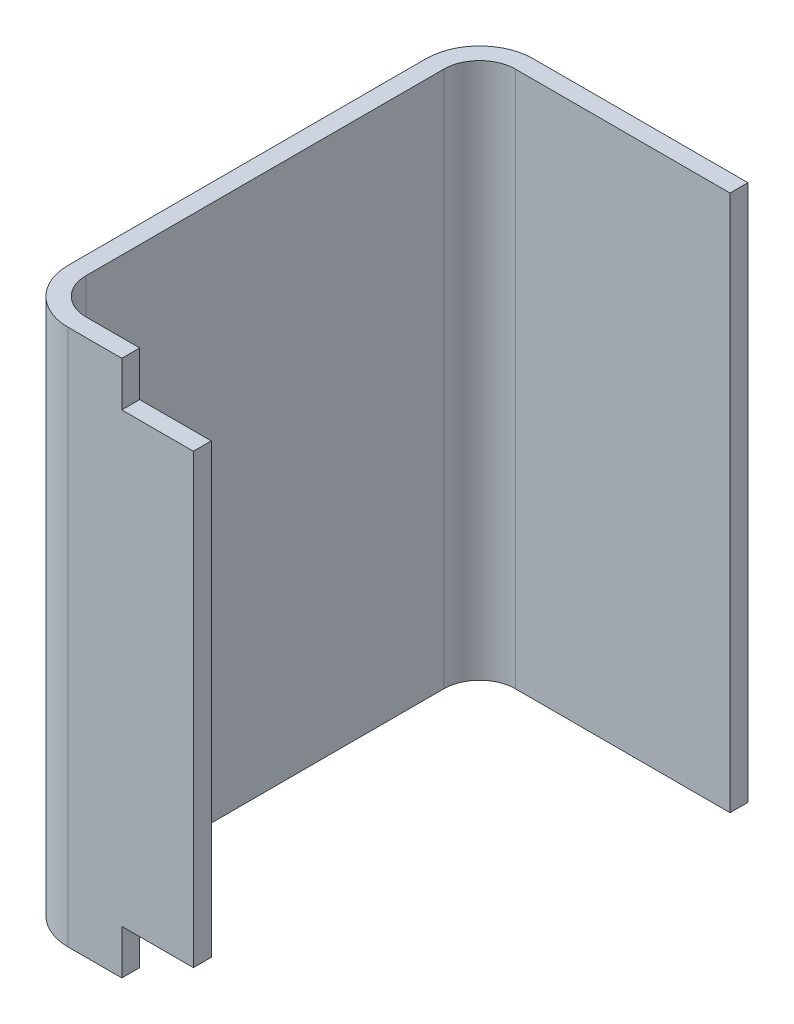
ISO-10303-21;
HEADER;
FILE_DESCRIPTION(('STEP AP214'),'2;1');
FILE_NAME('part.step','',(''),(''),'','','');
FILE_SCHEMA(('AUTOMOTIVE_DESIGN { 1 0 10303 214 1 1 1 1 }'));
ENDSEC;
DATA;
#1=APPLICATION_CONTEXT('core data for automotive mechanical design processes');
#2=APPLICATION_PROTOCOL_DEFINITION('international standard','automotive_design',2000,#1);
#3=PRODUCT_CONTEXT('',#1,'mechanical');
#4=PRODUCT('Part','Part','',(#3));
#5=PRODUCT_RELATED_PRODUCT_CATEGORY('part','',(#4));
#6=PRODUCT_DEFINITION_FORMATION('','',#4);
#7=PRODUCT_DEFINITION_CONTEXT('part definition',#1,'design');
#8=PRODUCT_DEFINITION('design','',#6,#7);
#9=PRODUCT_DEFINITION_SHAPE('','',#8);
#10=(LENGTH_UNIT() NAMED_UNIT(*) SI_UNIT(.MILLI.,.METRE.));
#11=(NAMED_UNIT(*) PLANE_ANGLE_UNIT() SI_UNIT($,.RADIAN.));
#12=(NAMED_UNIT(*) SI_UNIT($,.STERADIAN.) SOLID_ANGLE_UNIT());
#13=UNCERTAINTY_MEASURE_WITH_UNIT(LENGTH_MEASURE(1.E-05),#10,'distance_accuracy_value','');
#14=(GEOMETRIC_REPRESENTATION_CONTEXT(3) GLOBAL_UNCERTAINTY_ASSIGNED_CONTEXT((#13)) GLOBAL_UNIT_ASSIGNED_CONTEXT((#10,
#11,#12)) REPRESENTATION_CONTEXT('',''));
#15=CARTESIAN_POINT('',(0.,0.,0.));
#16=DIRECTION('',(0.,0.,1.));
#17=DIRECTION('',(1.,0.,0.));
#18=AXIS2_PLACEMENT_3D('',#15,#16,#17);
#19=CARTESIAN_POINT('',(-0.24,-0.125,0.26));
#20=DIRECTION('',(0.,1.,0.));
#21=DIRECTION('',(1.,0.,0.));
#22=AXIS2_PLACEMENT_3D('',#19,#20,#21);
#23=PLANE('',#22);
#24=DIRECTION('',(-1.,0.,0.));
#25=VECTOR('',#24,1.);
#26=CARTESIAN_POINT('',(-0.265,-0.125,0.25));
#27=LINE('',#26,#25);
#28=CARTESIAN_POINT('',(-0.2,-0.125,0.25));
#29=VERTEX_POINT('',#28);
#30=CARTESIAN_POINT('',(-0.24,-0.125,0.25));
#31=VERTEX_POINT('',#30);
#32=EDGE_CURVE('E11',#29,#31,#27,.T.);
#33=ORIENTED_EDGE('',*,*,#32,.F.);
#34=DIRECTION('',(0.,0.,-1.));
#35=VECTOR('',#34,1.);
#36=CARTESIAN_POINT('',(-0.2,-0.125,0.26));
#37=LINE('',#36,#35);
#38=CARTESIAN_POINT('',(-0.2,-0.125,0.26));
#39=VERTEX_POINT('',#38);
#40=EDGE_CURVE('E24',#39,#29,#37,.T.);
#41=ORIENTED_EDGE('',*,*,#40,.F.);
#42=DIRECTION('',(1.,0.,0.));
#43=VECTOR('',#42,1.);
#44=CARTESIAN_POINT('',(-0.12,-0.125,0.26));
#45=LINE('',#44,#43);
#46=CARTESIAN_POINT('',(-0.24,-0.125,0.26));
#47=VERTEX_POINT('',#46);
#48=EDGE_CURVE('E256',#47,#39,#45,.T.);
#49=ORIENTED_EDGE('',*,*,#48,.F.);
#50=DIRECTION('',(0.,0.,-1.));
#51=VECTOR('',#50,1.);
#52=CARTESIAN_POINT('',(-0.24,-0.125,0.26));
#53=LINE('',#52,#51);
#54=EDGE_CURVE('E254',#47,#31,#53,.T.);
#55=ORIENTED_EDGE('',*,*,#54,.T.);
#56=EDGE_LOOP('',(#33,#41,#49,#55));
#57=FACE_BOUND('',#56,.T.);
#58=ADVANCED_FACE('F17',(#57),#23,.F.);
#59=CARTESIAN_POINT('',(-0.24,-0.15,0.26));
#60=DIRECTION('',(-1.,0.,0.));
#61=DIRECTION('',(0.,1.,0.));
#62=AXIS2_PLACEMENT_3D('',#59,#60,#61);
#63=PLANE('',#62);
#64=DIRECTION('',(0.,-1.,0.));
#65=VECTOR('',#64,1.);
#66=CARTESIAN_POINT('',(-0.24,0.,0.25));
#67=LINE('',#66,#65);
#68=CARTESIAN_POINT('',(-0.24,-0.15,0.25));
#69=VERTEX_POINT('',#68);
#70=EDGE_CURVE('E252',#31,#69,#67,.T.);
#71=ORIENTED_EDGE('',*,*,#70,.F.);
#72=ORIENTED_EDGE('',*,*,#54,.F.);
#73=DIRECTION('',(0.,1.,0.));
#74=VECTOR('',#73,1.);
#75=CARTESIAN_POINT('',(-0.24,-0.075,0.26));
#76=LINE('',#75,#74);
#77=CARTESIAN_POINT('',(-0.24,-0.15,0.26));
#78=VERTEX_POINT('',#77);
#79=EDGE_CURVE('E249',#78,#47,#76,.T.);
#80=ORIENTED_EDGE('',*,*,#79,.F.);
#81=DIRECTION('',(0.,0.,1.));
#82=VECTOR('',#81,1.);
#83=CARTESIAN_POINT('',(-0.24,-0.15,0.13));
#84=LINE('',#83,#82);
#85=EDGE_CURVE('E247',#69,#78,#84,.T.);
#86=ORIENTED_EDGE('',*,*,#85,.F.);
#87=EDGE_LOOP('',(#71,#72,#80,#86));
#88=FACE_BOUND('',#87,.T.);
#89=ADVANCED_FACE('F273',(#88),#63,.F.);
#90=CARTESIAN_POINT('',(-0.24,0.125,0.26));
#91=DIRECTION('',(-1.,0.,0.));
#92=DIRECTION('',(0.,1.,0.));
#93=AXIS2_PLACEMENT_3D('',#90,#91,#92);
#94=PLANE('',#93);
#95=DIRECTION('',(0.,-1.,0.));
#96=VECTOR('',#95,1.);
#97=CARTESIAN_POINT('',(-0.24,0.1375,0.25));
#98=LINE('',#97,#96);
#99=CARTESIAN_POINT('',(-0.24,0.15,0.25));
#100=VERTEX_POINT('',#99);
#101=CARTESIAN_POINT('',(-0.24,0.125,0.25));
#102=VERTEX_POINT('',#101);
#103=EDGE_CURVE('E245',#100,#102,#98,.T.);
#104=ORIENTED_EDGE('',*,*,#103,.F.);
#105=DIRECTION('',(0.,0.,-1.));
#106=VECTOR('',#105,1.);
#107=CARTESIAN_POINT('',(-0.24,0.15,0.13));
#108=LINE('',#107,#106);
#109=CARTESIAN_POINT('',(-0.24,0.15,0.26));
#110=VERTEX_POINT('',#109);
#111=EDGE_CURVE('E242',#110,#100,#108,.T.);
#112=ORIENTED_EDGE('',*,*,#111,.F.);
#113=DIRECTION('',(0.,1.,0.));
#114=VECTOR('',#113,1.);
#115=CARTESIAN_POINT('',(-0.24,0.0625,0.26));
#116=LINE('',#115,#114);
#117=CARTESIAN_POINT('',(-0.24,0.125,0.26));
#118=VERTEX_POINT('',#117);
#119=EDGE_CURVE('E239',#118,#110,#116,.T.);
#120=ORIENTED_EDGE('',*,*,#119,.F.);
#121=DIRECTION('',(0.,0.,-1.));
#122=VECTOR('',#121,1.);
#123=CARTESIAN_POINT('',(-0.24,0.125,0.26));
#124=LINE('',#123,#122);
#125=EDGE_CURVE('E236',#118,#102,#124,.T.);
#126=ORIENTED_EDGE('',*,*,#125,.T.);
#127=EDGE_LOOP('',(#104,#112,#120,#126));
#128=FACE_BOUND('',#127,.T.);
#129=ADVANCED_FACE('F307',(#128),#94,.F.);
#130=CARTESIAN_POINT('',(-0.2,0.125,0.26));
#131=DIRECTION('',(0.,-1.,0.));
#132=DIRECTION('',(-1.,0.,0.));
#133=AXIS2_PLACEMENT_3D('',#130,#131,#132);
#134=PLANE('',#133);
#135=DIRECTION('',(1.,0.,0.));
#136=VECTOR('',#135,1.);
#137=CARTESIAN_POINT('',(-0.245,0.125,0.25));
#138=LINE('',#137,#136);
#139=CARTESIAN_POINT('',(-0.2,0.125,0.25));
#140=VERTEX_POINT('',#139);
#141=EDGE_CURVE('E234',#102,#140,#138,.T.);
#142=ORIENTED_EDGE('',*,*,#141,.F.);
#143=ORIENTED_EDGE('',*,*,#125,.F.);
#144=DIRECTION('',(-1.,0.,0.));
#145=VECTOR('',#144,1.);
#146=CARTESIAN_POINT('',(-0.0999999999999999,0.125,0.26));
#147=LINE('',#146,#145);
#148=CARTESIAN_POINT('',(-0.2,0.125,0.26));
#149=VERTEX_POINT('',#148);
#150=EDGE_CURVE('E231',#149,#118,#147,.T.);
#151=ORIENTED_EDGE('',*,*,#150,.F.);
#152=DIRECTION('',(0.,0.,1.));
#153=VECTOR('',#152,1.);
#154=CARTESIAN_POINT('',(-0.2,0.125,0.26));
#155=LINE('',#154,#153);
#156=EDGE_CURVE('E228',#140,#149,#155,.T.);
#157=ORIENTED_EDGE('',*,*,#156,.F.);
#158=EDGE_LOOP('',(#142,#143,#151,#157));
#159=FACE_BOUND('',#158,.T.);
#160=ADVANCED_FACE('F267',(#159),#134,.F.);
#161=CARTESIAN_POINT('',(0.3,0.15,0.));
#162=DIRECTION('',(0.,1.,0.));
#163=DIRECTION('',(-1.,0.,0.));
#164=AXIS2_PLACEMENT_3D('',#161,#162,#163);
#165=PLANE('',#164);
#166=ORIENTED_EDGE('',*,*,#111,.T.);
#167=DIRECTION('',(-1.,0.,0.));
#168=VECTOR('',#167,1.);
#169=CARTESIAN_POINT('',(0.00500000000000001,0.15,0.25));
#170=LINE('',#169,#168);
#171=CARTESIAN_POINT('',(-0.27,0.15,0.25));
#172=VERTEX_POINT('',#171);
#173=EDGE_CURVE('E226',#100,#172,#170,.T.);
#174=ORIENTED_EDGE('',*,*,#173,.T.);
#175=CARTESIAN_POINT('',(-0.27,0.15,0.23));
#176=DIRECTION('',(0.,1.,0.));
#177=DIRECTION('',(-0.707106781186548,0.,0.707106781186548));
#178=AXIS2_PLACEMENT_3D('',#175,#176,#177);
#179=CIRCLE('',#178,0.02);
#180=CARTESIAN_POINT('',(-0.29,0.15,0.23));
#181=VERTEX_POINT('',#180);
#182=EDGE_CURVE('E224',#181,#172,#179,.T.);
#183=ORIENTED_EDGE('',*,*,#182,.F.);
#184=DIRECTION('',(0.,0.,-1.));
#185=VECTOR('',#184,1.);
#186=CARTESIAN_POINT('',(-0.29,0.15,0.00500000000000013));
#187=LINE('',#186,#185);
#188=CARTESIAN_POINT('',(-0.29,0.15,0.0300000000000001));
#189=VERTEX_POINT('',#188);
#190=EDGE_CURVE('E132',#181,#189,#187,.T.);
#191=ORIENTED_EDGE('',*,*,#190,.T.);
#192=CARTESIAN_POINT('',(-0.27,0.15,0.0300000000000001));
#193=DIRECTION('',(0.,1.,0.));
#194=DIRECTION('',(-0.707106781186548,0.,-0.707106781186547));
#195=AXIS2_PLACEMENT_3D('',#192,#193,#194);
#196=CIRCLE('',#195,0.02);
#197=CARTESIAN_POINT('',(-0.27,0.15,0.0100000000000001));
#198=VERTEX_POINT('',#197);
#199=EDGE_CURVE('E220',#198,#189,#196,.T.);
#200=ORIENTED_EDGE('',*,*,#199,.F.);
#201=DIRECTION('',(1.,0.,0.));
#202=VECTOR('',#201,1.);
#203=CARTESIAN_POINT('',(0.295,0.15,0.01));
#204=LINE('',#203,#202);
#205=CARTESIAN_POINT('',(-0.15,0.15,0.01));
#206=VERTEX_POINT('',#205);
#207=EDGE_CURVE('E218',#198,#206,#204,.T.);
#208=ORIENTED_EDGE('',*,*,#207,.T.);
#209=DIRECTION('',(0.,0.,-1.));
#210=VECTOR('',#209,1.);
#211=CARTESIAN_POINT('',(-0.15,0.15,0.));
#212=LINE('',#211,#210);
#213=CARTESIAN_POINT('',(-0.15,0.15,0.));
#214=VERTEX_POINT('',#213);
#215=EDGE_CURVE('E216',#206,#214,#212,.T.);
#216=ORIENTED_EDGE('',*,*,#215,.T.);
#217=DIRECTION('',(-1.,0.,0.));
#218=VECTOR('',#217,1.);
#219=CARTESIAN_POINT('',(0.3,0.15,0.));
#220=LINE('',#219,#218);
#221=CARTESIAN_POINT('',(-0.27,0.15,0.));
#222=VERTEX_POINT('',#221);
#223=EDGE_CURVE('E214',#214,#222,#220,.T.);
#224=ORIENTED_EDGE('',*,*,#223,.T.);
#225=CARTESIAN_POINT('',(-0.27,0.15,0.03));
#226=DIRECTION('',(0.,-1.,0.));
#227=DIRECTION('',(-0.707106781186547,0.,-0.707106781186548));
#228=AXIS2_PLACEMENT_3D('',#225,#226,#227);
#229=CIRCLE('',#228,0.03);
#230=CARTESIAN_POINT('',(-0.3,0.15,0.03));
#231=VERTEX_POINT('',#230);
#232=EDGE_CURVE('E211',#231,#222,#229,.T.);
#233=ORIENTED_EDGE('',*,*,#232,.F.);
#234=DIRECTION('',(0.,0.,1.));
#235=VECTOR('',#234,1.);
#236=CARTESIAN_POINT('',(-0.3,0.15,0.));
#237=LINE('',#236,#235);
#238=CARTESIAN_POINT('',(-0.3,0.15,0.23));
#239=VERTEX_POINT('',#238);
#240=EDGE_CURVE('E209',#231,#239,#237,.T.);
#241=ORIENTED_EDGE('',*,*,#240,.T.);
#242=CARTESIAN_POINT('',(-0.27,0.15,0.23));
#243=DIRECTION('',(0.,-1.,0.));
#244=DIRECTION('',(-0.707106781186548,0.,0.707106781186548));
#245=AXIS2_PLACEMENT_3D('',#242,#243,#244);
#246=CIRCLE('',#245,0.03);
#247=CARTESIAN_POINT('',(-0.27,0.15,0.26));
#248=VERTEX_POINT('',#247);
#249=EDGE_CURVE('E206',#248,#239,#246,.T.);
#250=ORIENTED_EDGE('',*,*,#249,.F.);
#251=DIRECTION('',(-1.,0.,0.));
#252=VECTOR('',#251,1.);
#253=CARTESIAN_POINT('',(0.3,0.15,0.26));
#254=LINE('',#253,#252);
#255=EDGE_CURVE('E203',#110,#248,#254,.T.);
#256=ORIENTED_EDGE('',*,*,#255,.F.);
#257=EDGE_LOOP('',(#166,#174,#183,#191,#200,#208,#216,#224,#233,#241,#250,#256));
#258=FACE_BOUND('',#257,.T.);
#259=ADVANCED_FACE('F305',(#258),#165,.T.);
#260=CARTESIAN_POINT('',(-0.2,-0.184006542055292,0.26));
#261=DIRECTION('',(-1.,0.,0.));
#262=DIRECTION('',(0.,1.,0.));
#263=AXIS2_PLACEMENT_3D('',#260,#261,#262);
#264=PLANE('',#263);
#265=ORIENTED_EDGE('',*,*,#40,.T.);
#266=DIRECTION('',(0.,1.,0.));
#267=VECTOR('',#266,1.);
#268=CARTESIAN_POINT('',(-0.2,0.184006542055292,0.25));
#269=LINE('',#268,#267);
#270=EDGE_CURVE('E200',#29,#140,#269,.T.);
#271=ORIENTED_EDGE('',*,*,#270,.T.);
#272=ORIENTED_EDGE('',*,*,#156,.T.);
#273=DIRECTION('',(0.,1.,0.));
#274=VECTOR('',#273,1.);
#275=CARTESIAN_POINT('',(-0.2,-0.0920032710276462,0.26));
#276=LINE('',#275,#274);
#277=EDGE_CURVE('E197',#39,#149,#276,.T.);
#278=ORIENTED_EDGE('',*,*,#277,.F.);
#279=EDGE_LOOP('',(#265,#271,#272,#278));
#280=FACE_BOUND('',#279,.T.);
#281=ADVANCED_FACE('F260',(#280),#264,.F.);
#282=CARTESIAN_POINT('',(-0.29,0.15,0.25));
#283=DIRECTION('',(0.,0.,1.));
#284=DIRECTION('',(1.,0.,0.));
#285=AXIS2_PLACEMENT_3D('',#282,#283,#284);
#286=PLANE('',#285);
#287=ORIENTED_EDGE('',*,*,#32,.T.);
#288=ORIENTED_EDGE('',*,*,#70,.T.);
#289=DIRECTION('',(1.,0.,0.));
#290=VECTOR('',#289,1.);
#291=CARTESIAN_POINT('',(-0.295,-0.15,0.25));
#292=LINE('',#291,#290);
#293=CARTESIAN_POINT('',(-0.27,-0.15,0.25));
#294=VERTEX_POINT('',#293);
#295=EDGE_CURVE('E195',#294,#69,#292,.T.);
#296=ORIENTED_EDGE('',*,*,#295,.F.);
#297=DIRECTION('',(0.,-1.,0.));
#298=VECTOR('',#297,1.);
#299=CARTESIAN_POINT('',(-0.27,0.15,0.25));
#300=LINE('',#299,#298);
#301=EDGE_CURVE('E142',#172,#294,#300,.T.);
#302=ORIENTED_EDGE('',*,*,#301,.F.);
#303=ORIENTED_EDGE('',*,*,#173,.F.);
#304=ORIENTED_EDGE('',*,*,#103,.T.);
#305=ORIENTED_EDGE('',*,*,#141,.T.);
#306=ORIENTED_EDGE('',*,*,#270,.F.);
#307=EDGE_LOOP('',(#287,#288,#296,#302,#303,#304,#305,#306));
#308=FACE_BOUND('',#307,.T.);
#309=ADVANCED_FACE('F261',(#308),#286,.F.);
#310=CARTESIAN_POINT('',(-0.27,0.075,0.03));
#311=DIRECTION('',(0.,-1.,0.));
#312=DIRECTION('',(-0.707106781186547,0.,-0.707106781186548));
#313=AXIS2_PLACEMENT_3D('',#310,#311,#312);
#314=CYLINDRICAL_SURFACE('',#313,0.03);
#315=CARTESIAN_POINT('',(-0.27,-0.15,0.03));
#316=DIRECTION('',(0.,1.,0.));
#317=DIRECTION('',(-0.707106781186547,0.,-0.707106781186548));
#318=AXIS2_PLACEMENT_3D('',#315,#316,#317);
#319=CIRCLE('',#318,0.03);
#320=CARTESIAN_POINT('',(-0.27,-0.15,0.));
#321=VERTEX_POINT('',#320);
#322=CARTESIAN_POINT('',(-0.3,-0.15,0.03));
#323=VERTEX_POINT('',#322);
#324=EDGE_CURVE('E192',#321,#323,#319,.T.);
#325=ORIENTED_EDGE('',*,*,#324,.T.);
#326=DIRECTION('',(0.,1.,0.));
#327=VECTOR('',#326,1.);
#328=CARTESIAN_POINT('',(-0.3,0.075,0.03));
#329=LINE('',#328,#327);
#330=EDGE_CURVE('E189',#323,#231,#329,.T.);
#331=ORIENTED_EDGE('',*,*,#330,.T.);
#332=ORIENTED_EDGE('',*,*,#232,.T.);
#333=DIRECTION('',(0.,-1.,0.));
#334=VECTOR('',#333,1.);
#335=CARTESIAN_POINT('',(-0.27,0.075,0.));
#336=LINE('',#335,#334);
#337=EDGE_CURVE('E186',#222,#321,#336,.T.);
#338=ORIENTED_EDGE('',*,*,#337,.T.);
#339=EDGE_LOOP('',(#325,#331,#332,#338));
#340=FACE_BOUND('',#339,.T.);
#341=ADVANCED_FACE('F287',(#340),#314,.T.);
#342=CARTESIAN_POINT('',(0.,0.,0.));
#343=DIRECTION('',(0.,0.,1.));
#344=DIRECTION('',(1.,0.,0.));
#345=AXIS2_PLACEMENT_3D('',#342,#343,#344);
#346=PLANE('',#345);
#347=ORIENTED_EDGE('',*,*,#337,.F.);
#348=ORIENTED_EDGE('',*,*,#223,.F.);
#349=DIRECTION('',(0.,-1.,0.));
#350=VECTOR('',#349,1.);
#351=CARTESIAN_POINT('',(-0.15,0.0937574995010894,0.));
#352=LINE('',#351,#350);
#353=CARTESIAN_POINT('',(-0.15,-0.15,0.));
#354=VERTEX_POINT('',#353);
#355=EDGE_CURVE('E184',#214,#354,#352,.T.);
#356=ORIENTED_EDGE('',*,*,#355,.T.);
#357=DIRECTION('',(1.,0.,0.));
#358=VECTOR('',#357,1.);
#359=CARTESIAN_POINT('',(-0.3,-0.15,0.));
#360=LINE('',#359,#358);
#361=EDGE_CURVE('E181',#321,#354,#360,.T.);
#362=ORIENTED_EDGE('',*,*,#361,.F.);
#363=EDGE_LOOP('',(#347,#348,#356,#362));
#364=FACE_BOUND('',#363,.T.);
#365=ADVANCED_FACE('F292',(#364),#346,.F.);
#366=CARTESIAN_POINT('',(-0.27,0.075,0.23));
#367=DIRECTION('',(0.,-1.,0.));
#368=DIRECTION('',(-0.707106781186548,0.,0.707106781186548));
#369=AXIS2_PLACEMENT_3D('',#366,#367,#368);
#370=CYLINDRICAL_SURFACE('',#369,0.03);
#371=CARTESIAN_POINT('',(-0.27,-0.15,0.23));
#372=DIRECTION('',(0.,1.,0.));
#373=DIRECTION('',(-0.707106781186548,0.,0.707106781186548));
#374=AXIS2_PLACEMENT_3D('',#371,#372,#373);
#375=CIRCLE('',#374,0.03);
#376=CARTESIAN_POINT('',(-0.3,-0.15,0.23));
#377=VERTEX_POINT('',#376);
#378=CARTESIAN_POINT('',(-0.27,-0.15,0.26));
#379=VERTEX_POINT('',#378);
#380=EDGE_CURVE('E179',#377,#379,#375,.T.);
#381=ORIENTED_EDGE('',*,*,#380,.T.);
#382=DIRECTION('',(0.,1.,0.));
#383=VECTOR('',#382,1.);
#384=CARTESIAN_POINT('',(-0.27,0.075,0.26));
#385=LINE('',#384,#383);
#386=EDGE_CURVE('E176',#379,#248,#385,.T.);
#387=ORIENTED_EDGE('',*,*,#386,.T.);
#388=ORIENTED_EDGE('',*,*,#249,.T.);
#389=DIRECTION('',(0.,-1.,0.));
#390=VECTOR('',#389,1.);
#391=CARTESIAN_POINT('',(-0.3,0.075,0.23));
#392=LINE('',#391,#390);
#393=EDGE_CURVE('E173',#239,#377,#392,.T.);
#394=ORIENTED_EDGE('',*,*,#393,.T.);
#395=EDGE_LOOP('',(#381,#387,#388,#394));
#396=FACE_BOUND('',#395,.T.);
#397=ADVANCED_FACE('F279',(#396),#370,.T.);
#398=CARTESIAN_POINT('',(0.,0.,0.26));
#399=DIRECTION('',(0.,0.,1.));
#400=DIRECTION('',(1.,0.,0.));
#401=AXIS2_PLACEMENT_3D('',#398,#399,#400);
#402=PLANE('',#401);
#403=ORIENTED_EDGE('',*,*,#48,.T.);
#404=ORIENTED_EDGE('',*,*,#277,.T.);
#405=ORIENTED_EDGE('',*,*,#150,.T.);
#406=ORIENTED_EDGE('',*,*,#119,.T.);
#407=ORIENTED_EDGE('',*,*,#255,.T.);
#408=ORIENTED_EDGE('',*,*,#386,.F.);
#409=DIRECTION('',(1.,0.,0.));
#410=VECTOR('',#409,1.);
#411=CARTESIAN_POINT('',(-0.3,-0.15,0.26));
#412=LINE('',#411,#410);
#413=EDGE_CURVE('E170',#379,#78,#412,.T.);
#414=ORIENTED_EDGE('',*,*,#413,.T.);
#415=ORIENTED_EDGE('',*,*,#79,.T.);
#416=EDGE_LOOP('',(#403,#404,#405,#406,#407,#408,#414,#415));
#417=FACE_BOUND('',#416,.T.);
#418=ADVANCED_FACE('F269',(#417),#402,.T.);
#419=CARTESIAN_POINT('',(-0.27,0.15,0.0300000000000001));
#420=DIRECTION('',(0.,1.,0.));
#421=DIRECTION('',(-0.707106781186548,0.,-0.707106781186547));
#422=AXIS2_PLACEMENT_3D('',#419,#420,#421);
#423=CYLINDRICAL_SURFACE('',#422,0.02);
#424=CARTESIAN_POINT('',(-0.27,-0.15,0.0300000000000001));
#425=DIRECTION('',(0.,-1.,0.));
#426=DIRECTION('',(-0.707106781186548,0.,-0.707106781186547));
#427=AXIS2_PLACEMENT_3D('',#424,#425,#426);
#428=CIRCLE('',#427,0.02);
#429=CARTESIAN_POINT('',(-0.29,-0.15,0.0300000000000001));
#430=VERTEX_POINT('',#429);
#431=CARTESIAN_POINT('',(-0.27,-0.15,0.0100000000000001));
#432=VERTEX_POINT('',#431);
#433=EDGE_CURVE('E152',#430,#432,#428,.T.);
#434=ORIENTED_EDGE('',*,*,#433,.T.);
#435=DIRECTION('',(0.,1.,0.));
#436=VECTOR('',#435,1.);
#437=CARTESIAN_POINT('',(-0.27,0.15,0.0100000000000001));
#438=LINE('',#437,#436);
#439=EDGE_CURVE('E166',#432,#198,#438,.T.);
#440=ORIENTED_EDGE('',*,*,#439,.T.);
#441=ORIENTED_EDGE('',*,*,#199,.T.);
#442=DIRECTION('',(0.,-1.,0.));
#443=VECTOR('',#442,1.);
#444=CARTESIAN_POINT('',(-0.29,0.15,0.0300000000000001));
#445=LINE('',#444,#443);
#446=EDGE_CURVE('E164',#189,#430,#445,.T.);
#447=ORIENTED_EDGE('',*,*,#446,.T.);
#448=EDGE_LOOP('',(#434,#440,#441,#447));
#449=FACE_BOUND('',#448,.T.);
#450=ADVANCED_FACE('F303',(#449),#423,.F.);
#451=CARTESIAN_POINT('',(0.29,0.15,0.01));
#452=DIRECTION('',(0.,0.,-1.));
#453=DIRECTION('',(-1.,0.,0.));
#454=AXIS2_PLACEMENT_3D('',#451,#452,#453);
#455=PLANE('',#454);
#456=DIRECTION('',(-1.,0.,0.));
#457=VECTOR('',#456,1.);
#458=CARTESIAN_POINT('',(-0.005,-0.15,0.0100000000000001));
#459=LINE('',#458,#457);
#460=CARTESIAN_POINT('',(-0.15,-0.15,0.01));
#461=VERTEX_POINT('',#460);
#462=EDGE_CURVE('E162',#461,#432,#459,.T.);
#463=ORIENTED_EDGE('',*,*,#462,.F.);
#464=DIRECTION('',(0.,-1.,0.));
#465=VECTOR('',#464,1.);
#466=CARTESIAN_POINT('',(-0.15,0.187514999002179,0.01));
#467=LINE('',#466,#465);
#468=EDGE_CURVE('E145',#206,#461,#467,.T.);
#469=ORIENTED_EDGE('',*,*,#468,.F.);
#470=ORIENTED_EDGE('',*,*,#207,.F.);
#471=ORIENTED_EDGE('',*,*,#439,.F.);
#472=EDGE_LOOP('',(#463,#469,#470,#471));
#473=FACE_BOUND('',#472,.T.);
#474=ADVANCED_FACE('F301',(#473),#455,.F.);
#475=CARTESIAN_POINT('',(-0.27,0.15,0.23));
#476=DIRECTION('',(0.,-1.,0.));
#477=DIRECTION('',(-0.707106781186548,0.,0.707106781186548));
#478=AXIS2_PLACEMENT_3D('',#475,#476,#477);
#479=CYLINDRICAL_SURFACE('',#478,0.02);
#480=ORIENTED_EDGE('',*,*,#182,.T.);
#481=ORIENTED_EDGE('',*,*,#301,.T.);
#482=CARTESIAN_POINT('',(-0.27,-0.15,0.23));
#483=DIRECTION('',(0.,-1.,0.));
#484=DIRECTION('',(-0.707106781186548,0.,0.707106781186548));
#485=AXIS2_PLACEMENT_3D('',#482,#483,#484);
#486=CIRCLE('',#485,0.02);
#487=CARTESIAN_POINT('',(-0.29,-0.15,0.23));
#488=VERTEX_POINT('',#487);
#489=EDGE_CURVE('E135',#294,#488,#486,.T.);
#490=ORIENTED_EDGE('',*,*,#489,.T.);
#491=DIRECTION('',(0.,1.,0.));
#492=VECTOR('',#491,1.);
#493=CARTESIAN_POINT('',(-0.29,0.15,0.23));
#494=LINE('',#493,#492);
#495=EDGE_CURVE('E126',#488,#181,#494,.T.);
#496=ORIENTED_EDGE('',*,*,#495,.T.);
#497=EDGE_LOOP('',(#480,#481,#490,#496));
#498=FACE_BOUND('',#497,.T.);
#499=ADVANCED_FACE('F140',(#498),#479,.F.);
#500=CARTESIAN_POINT('',(-0.3,0.15,0.));
#501=DIRECTION('',(-1.,0.,0.));
#502=DIRECTION('',(0.,-1.,0.));
#503=AXIS2_PLACEMENT_3D('',#500,#501,#502);
#504=PLANE('',#503);
#505=ORIENTED_EDGE('',*,*,#330,.F.);
#506=DIRECTION('',(0.,0.,1.));
#507=VECTOR('',#506,1.);
#508=CARTESIAN_POINT('',(-0.3,-0.15,0.));
#509=LINE('',#508,#507);
#510=EDGE_CURVE('E136',#323,#377,#509,.T.);
#511=ORIENTED_EDGE('',*,*,#510,.T.);
#512=ORIENTED_EDGE('',*,*,#393,.F.);
#513=ORIENTED_EDGE('',*,*,#240,.F.);
#514=EDGE_LOOP('',(#505,#511,#512,#513));
#515=FACE_BOUND('',#514,.T.);
#516=ADVANCED_FACE('F284',(#515),#504,.T.);
#517=CARTESIAN_POINT('',(-0.15,0.187514999002179,0.));
#518=DIRECTION('',(-1.,0.,0.));
#519=DIRECTION('',(0.,-1.,0.));
#520=AXIS2_PLACEMENT_3D('',#517,#518,#519);
#521=PLANE('',#520);
#522=DIRECTION('',(0.,0.,1.));
#523=VECTOR('',#522,1.);
#524=CARTESIAN_POINT('',(-0.15,-0.15,0.));
#525=LINE('',#524,#523);
#526=EDGE_CURVE('E153',#354,#461,#525,.T.);
#527=ORIENTED_EDGE('',*,*,#526,.F.);
#528=ORIENTED_EDGE('',*,*,#355,.F.);
#529=ORIENTED_EDGE('',*,*,#215,.F.);
#530=ORIENTED_EDGE('',*,*,#468,.T.);
#531=EDGE_LOOP('',(#527,#528,#529,#530));
#532=FACE_BOUND('',#531,.T.);
#533=ADVANCED_FACE('F296',(#532),#521,.F.);
#534=CARTESIAN_POINT('',(-0.3,-0.15,0.));
#535=DIRECTION('',(0.,-1.,0.));
#536=DIRECTION('',(1.,0.,0.));
#537=AXIS2_PLACEMENT_3D('',#534,#535,#536);
#538=PLANE('',#537);
#539=ORIENTED_EDGE('',*,*,#85,.T.);
#540=ORIENTED_EDGE('',*,*,#413,.F.);
#541=ORIENTED_EDGE('',*,*,#380,.F.);
#542=ORIENTED_EDGE('',*,*,#510,.F.);
#543=ORIENTED_EDGE('',*,*,#324,.F.);
#544=ORIENTED_EDGE('',*,*,#361,.T.);
#545=ORIENTED_EDGE('',*,*,#526,.T.);
#546=ORIENTED_EDGE('',*,*,#462,.T.);
#547=ORIENTED_EDGE('',*,*,#433,.F.);
#548=DIRECTION('',(0.,0.,1.));
#549=VECTOR('',#548,1.);
#550=CARTESIAN_POINT('',(-0.29,-0.15,0.00500000000000007));
#551=LINE('',#550,#549);
#552=EDGE_CURVE('E131',#430,#488,#551,.T.);
#553=ORIENTED_EDGE('',*,*,#552,.T.);
#554=ORIENTED_EDGE('',*,*,#489,.F.);
#555=ORIENTED_EDGE('',*,*,#295,.T.);
#556=EDGE_LOOP('',(#539,#540,#541,#542,#543,#544,#545,#546,#547,#553,#554,#555));
#557=FACE_BOUND('',#556,.T.);
#558=ADVANCED_FACE('F149',(#557),#538,.T.);
#559=CARTESIAN_POINT('',(-0.29,0.15,0.0100000000000001));
#560=DIRECTION('',(-1.,0.,0.));
#561=DIRECTION('',(0.,0.,1.));
#562=AXIS2_PLACEMENT_3D('',#559,#560,#561);
#563=PLANE('',#562);
#564=ORIENTED_EDGE('',*,*,#446,.F.);
#565=ORIENTED_EDGE('',*,*,#190,.F.);
#566=ORIENTED_EDGE('',*,*,#495,.F.);
#567=ORIENTED_EDGE('',*,*,#552,.F.);
#568=EDGE_LOOP('',(#564,#565,#566,#567));
#569=FACE_BOUND('',#568,.T.);
#570=ADVANCED_FACE('F129',(#569),#563,.F.);
#571=CLOSED_SHELL('',(#58,#89,#129,#160,#259,#281,#309,#341,#365,#397,#418,#450,#474,#499,#516,
#533,#558,#570));
#572=MANIFOLD_SOLID_BREP('B1',#571);
#573=ADVANCED_BREP_SHAPE_REPRESENTATION('',(#18,#572),#14);
#574=SHAPE_DEFINITION_REPRESENTATION(#9,#573);
ENDSEC;
END-ISO-10303-21;
